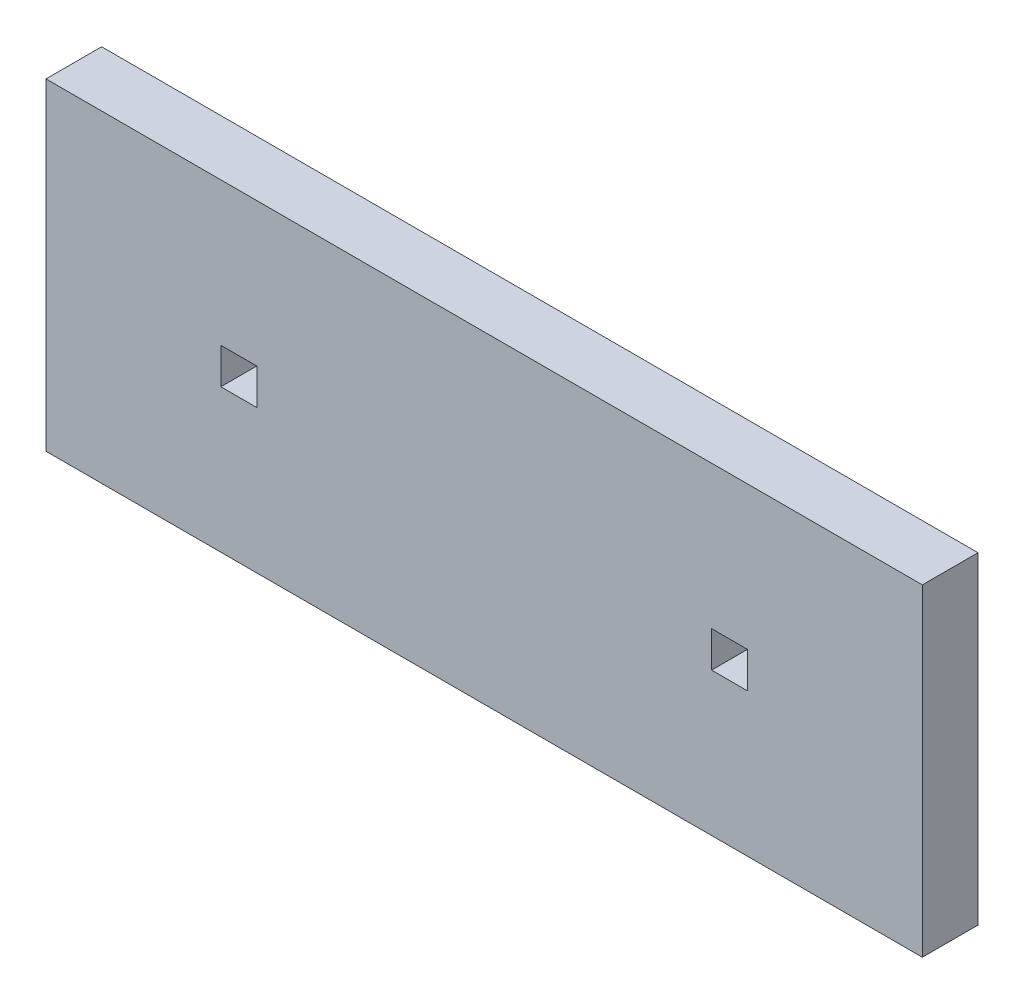
ISO-10303-21;
HEADER;
FILE_DESCRIPTION(('STEP AP214'),'2;1');
FILE_NAME('part.step','',(''),(''),'','','');
FILE_SCHEMA(('AUTOMOTIVE_DESIGN { 1 0 10303 214 1 1 1 1 }'));
ENDSEC;
DATA;
#1=APPLICATION_CONTEXT('core data for automotive mechanical design processes');
#2=APPLICATION_PROTOCOL_DEFINITION('international standard','automotive_design',2000,#1);
#3=PRODUCT_CONTEXT('',#1,'mechanical');
#4=PRODUCT('Part','Part','',(#3));
#5=PRODUCT_RELATED_PRODUCT_CATEGORY('part','',(#4));
#6=PRODUCT_DEFINITION_FORMATION('','',#4);
#7=PRODUCT_DEFINITION_CONTEXT('part definition',#1,'design');
#8=PRODUCT_DEFINITION('design','',#6,#7);
#9=PRODUCT_DEFINITION_SHAPE('','',#8);
#10=(LENGTH_UNIT() NAMED_UNIT(*) SI_UNIT(.MILLI.,.METRE.));
#11=(NAMED_UNIT(*) PLANE_ANGLE_UNIT() SI_UNIT($,.RADIAN.));
#12=(NAMED_UNIT(*) SI_UNIT($,.STERADIAN.) SOLID_ANGLE_UNIT());
#13=UNCERTAINTY_MEASURE_WITH_UNIT(LENGTH_MEASURE(1.E-05),#10,'distance_accuracy_value','');
#14=(GEOMETRIC_REPRESENTATION_CONTEXT(3) GLOBAL_UNCERTAINTY_ASSIGNED_CONTEXT((#13)) GLOBAL_UNIT_ASSIGNED_CONTEXT((#10,
#11,#12)) REPRESENTATION_CONTEXT('',''));
#15=CARTESIAN_POINT('',(0.,0.,0.));
#16=DIRECTION('',(0.,0.,1.));
#17=DIRECTION('',(1.,0.,0.));
#18=AXIS2_PLACEMENT_3D('',#15,#16,#17);
#19=CARTESIAN_POINT('',(0.,-2.61249429999999,3.175));
#20=DIRECTION('',(0.,-1.,0.));
#21=DIRECTION('',(0.,0.,-1.));
#22=AXIS2_PLACEMENT_3D('',#19,#20,#21);
#23=PLANE('',#22);
#24=DIRECTION('',(-1.,0.,0.));
#25=VECTOR('',#24,1.);
#26=CARTESIAN_POINT('',(0.,-2.61249429999999,0.));
#27=LINE('',#26,#25);
#28=CARTESIAN_POINT('',(15.025,-2.61249429999999,0.));
#29=VERTEX_POINT('',#28);
#30=CARTESIAN_POINT('',(12.975,-2.61249429999999,0.));
#31=VERTEX_POINT('',#30);
#32=EDGE_CURVE('E181',#29,#31,#27,.T.);
#33=ORIENTED_EDGE('',*,*,#32,.T.);
#34=DIRECTION('',(0.,0.,-1.));
#35=VECTOR('',#34,1.);
#36=CARTESIAN_POINT('',(12.975,-2.61249429999999,3.175));
#37=LINE('',#36,#35);
#38=CARTESIAN_POINT('',(12.975,-2.61249429999999,3.175));
#39=VERTEX_POINT('',#38);
#40=EDGE_CURVE('E11',#39,#31,#37,.T.);
#41=ORIENTED_EDGE('',*,*,#40,.F.);
#42=DIRECTION('',(-1.,0.,0.));
#43=VECTOR('',#42,1.);
#44=CARTESIAN_POINT('',(0.,-2.61249429999999,3.175));
#45=LINE('',#44,#43);
#46=CARTESIAN_POINT('',(15.025,-2.61249429999999,3.175));
#47=VERTEX_POINT('',#46);
#48=EDGE_CURVE('E140',#47,#39,#45,.T.);
#49=ORIENTED_EDGE('',*,*,#48,.F.);
#50=DIRECTION('',(0.,0.,-1.));
#51=VECTOR('',#50,1.);
#52=CARTESIAN_POINT('',(15.025,-2.61249429999999,3.175));
#53=LINE('',#52,#51);
#54=EDGE_CURVE('E56',#47,#29,#53,.T.);
#55=ORIENTED_EDGE('',*,*,#54,.T.);
#56=EDGE_LOOP('',(#33,#41,#49,#55));
#57=FACE_BOUND('',#56,.T.);
#58=ADVANCED_FACE('F37',(#57),#23,.F.);
#59=CARTESIAN_POINT('',(12.975,0.,3.175));
#60=DIRECTION('',(-1.,0.,0.));
#61=DIRECTION('',(0.,-1.,0.));
#62=AXIS2_PLACEMENT_3D('',#59,#60,#61);
#63=PLANE('',#62);
#64=DIRECTION('',(0.,1.,0.));
#65=VECTOR('',#64,1.);
#66=CARTESIAN_POINT('',(12.975,0.,0.));
#67=LINE('',#66,#65);
#68=CARTESIAN_POINT('',(12.975,-0.562494299999992,0.));
#69=VERTEX_POINT('',#68);
#70=EDGE_CURVE('E146',#31,#69,#67,.T.);
#71=ORIENTED_EDGE('',*,*,#70,.T.);
#72=DIRECTION('',(0.,0.,-1.));
#73=VECTOR('',#72,1.);
#74=CARTESIAN_POINT('',(12.975,-0.562494299999992,3.175));
#75=LINE('',#74,#73);
#76=CARTESIAN_POINT('',(12.975,-0.562494299999992,3.175));
#77=VERTEX_POINT('',#76);
#78=EDGE_CURVE('E47',#77,#69,#75,.T.);
#79=ORIENTED_EDGE('',*,*,#78,.F.);
#80=DIRECTION('',(0.,1.,0.));
#81=VECTOR('',#80,1.);
#82=CARTESIAN_POINT('',(12.975,0.,3.175));
#83=LINE('',#82,#81);
#84=EDGE_CURVE('E134',#39,#77,#83,.T.);
#85=ORIENTED_EDGE('',*,*,#84,.F.);
#86=ORIENTED_EDGE('',*,*,#40,.T.);
#87=EDGE_LOOP('',(#71,#79,#85,#86));
#88=FACE_BOUND('',#87,.T.);
#89=ADVANCED_FACE('F145',(#88),#63,.F.);
#90=CARTESIAN_POINT('',(0.,-0.562494299999991,3.175));
#91=DIRECTION('',(0.,-1.,0.));
#92=DIRECTION('',(1.,0.,0.));
#93=AXIS2_PLACEMENT_3D('',#90,#91,#92);
#94=PLANE('',#93);
#95=DIRECTION('',(-1.,0.,0.));
#96=VECTOR('',#95,1.);
#97=CARTESIAN_POINT('',(0.,-0.562494299999991,0.));
#98=LINE('',#97,#96);
#99=CARTESIAN_POINT('',(15.025,-0.562494299999992,0.));
#100=VERTEX_POINT('',#99);
#101=EDGE_CURVE('E184',#100,#69,#98,.T.);
#102=ORIENTED_EDGE('',*,*,#101,.F.);
#103=DIRECTION('',(0.,0.,-1.));
#104=VECTOR('',#103,1.);
#105=CARTESIAN_POINT('',(15.025,-0.562494299999992,3.175));
#106=LINE('',#105,#104);
#107=CARTESIAN_POINT('',(15.025,-0.562494299999992,3.175));
#108=VERTEX_POINT('',#107);
#109=EDGE_CURVE('E94',#108,#100,#106,.T.);
#110=ORIENTED_EDGE('',*,*,#109,.F.);
#111=DIRECTION('',(-1.,0.,0.));
#112=VECTOR('',#111,1.);
#113=CARTESIAN_POINT('',(0.,-0.562494299999991,3.175));
#114=LINE('',#113,#112);
#115=EDGE_CURVE('E139',#108,#77,#114,.T.);
#116=ORIENTED_EDGE('',*,*,#115,.T.);
#117=ORIENTED_EDGE('',*,*,#78,.T.);
#118=EDGE_LOOP('',(#102,#110,#116,#117));
#119=FACE_BOUND('',#118,.T.);
#120=ADVANCED_FACE('F150',(#119),#94,.T.);
#121=CARTESIAN_POINT('',(0.,-0.562494299999992,3.175));
#122=DIRECTION('',(0.,1.,0.));
#123=DIRECTION('',(0.,0.,1.));
#124=AXIS2_PLACEMENT_3D('',#121,#122,#123);
#125=PLANE('',#124);
#126=DIRECTION('',(1.,0.,0.));
#127=VECTOR('',#126,1.);
#128=CARTESIAN_POINT('',(0.,-0.562494299999992,0.));
#129=LINE('',#128,#127);
#130=CARTESIAN_POINT('',(-15.025,-0.562494299999992,0.));
#131=VERTEX_POINT('',#130);
#132=CARTESIAN_POINT('',(-12.975,-0.562494299999992,0.));
#133=VERTEX_POINT('',#132);
#134=EDGE_CURVE('E169',#131,#133,#129,.T.);
#135=ORIENTED_EDGE('',*,*,#134,.T.);
#136=DIRECTION('',(0.,0.,-1.));
#137=VECTOR('',#136,1.);
#138=CARTESIAN_POINT('',(-12.975,-0.562494299999992,3.175));
#139=LINE('',#138,#137);
#140=CARTESIAN_POINT('',(-12.975,-0.562494299999992,3.175));
#141=VERTEX_POINT('',#140);
#142=EDGE_CURVE('E191',#141,#133,#139,.T.);
#143=ORIENTED_EDGE('',*,*,#142,.F.);
#144=DIRECTION('',(1.,0.,0.));
#145=VECTOR('',#144,1.);
#146=CARTESIAN_POINT('',(0.,-0.562494299999992,3.175));
#147=LINE('',#146,#145);
#148=CARTESIAN_POINT('',(-15.025,-0.562494299999992,3.175));
#149=VERTEX_POINT('',#148);
#150=EDGE_CURVE('E226',#149,#141,#147,.T.);
#151=ORIENTED_EDGE('',*,*,#150,.F.);
#152=DIRECTION('',(0.,0.,-1.));
#153=VECTOR('',#152,1.);
#154=CARTESIAN_POINT('',(-15.025,-0.562494299999992,3.175));
#155=LINE('',#154,#153);
#156=EDGE_CURVE('E193',#149,#131,#155,.T.);
#157=ORIENTED_EDGE('',*,*,#156,.T.);
#158=EDGE_LOOP('',(#135,#143,#151,#157));
#159=FACE_BOUND('',#158,.T.);
#160=ADVANCED_FACE('F256',(#159),#125,.F.);
#161=CARTESIAN_POINT('',(-12.975,0.,3.175));
#162=DIRECTION('',(1.,0.,0.));
#163=DIRECTION('',(0.,1.,0.));
#164=AXIS2_PLACEMENT_3D('',#161,#162,#163);
#165=PLANE('',#164);
#166=DIRECTION('',(0.,-1.,0.));
#167=VECTOR('',#166,1.);
#168=CARTESIAN_POINT('',(-12.975,0.,0.));
#169=LINE('',#168,#167);
#170=CARTESIAN_POINT('',(-12.975,-2.61249429999999,0.));
#171=VERTEX_POINT('',#170);
#172=EDGE_CURVE('E172',#133,#171,#169,.T.);
#173=ORIENTED_EDGE('',*,*,#172,.T.);
#174=DIRECTION('',(0.,0.,-1.));
#175=VECTOR('',#174,1.);
#176=CARTESIAN_POINT('',(-12.975,-2.61249429999999,3.175));
#177=LINE('',#176,#175);
#178=CARTESIAN_POINT('',(-12.975,-2.61249429999999,3.175));
#179=VERTEX_POINT('',#178);
#180=EDGE_CURVE('E197',#179,#171,#177,.T.);
#181=ORIENTED_EDGE('',*,*,#180,.F.);
#182=DIRECTION('',(0.,-1.,0.));
#183=VECTOR('',#182,1.);
#184=CARTESIAN_POINT('',(-12.975,0.,3.175));
#185=LINE('',#184,#183);
#186=EDGE_CURVE('E235',#141,#179,#185,.T.);
#187=ORIENTED_EDGE('',*,*,#186,.F.);
#188=ORIENTED_EDGE('',*,*,#142,.T.);
#189=EDGE_LOOP('',(#173,#181,#187,#188));
#190=FACE_BOUND('',#189,.T.);
#191=ADVANCED_FACE('F258',(#190),#165,.F.);
#192=CARTESIAN_POINT('',(0.,-2.61249429999999,3.175));
#193=DIRECTION('',(0.,1.,0.));
#194=DIRECTION('',(0.,0.,1.));
#195=AXIS2_PLACEMENT_3D('',#192,#193,#194);
#196=PLANE('',#195);
#197=DIRECTION('',(1.,0.,0.));
#198=VECTOR('',#197,1.);
#199=CARTESIAN_POINT('',(0.,-2.61249429999999,0.));
#200=LINE('',#199,#198);
#201=CARTESIAN_POINT('',(-15.025,-2.61249429999999,0.));
#202=VERTEX_POINT('',#201);
#203=EDGE_CURVE('E175',#202,#171,#200,.T.);
#204=ORIENTED_EDGE('',*,*,#203,.F.);
#205=DIRECTION('',(0.,0.,-1.));
#206=VECTOR('',#205,1.);
#207=CARTESIAN_POINT('',(-15.025,-2.61249429999999,3.175));
#208=LINE('',#207,#206);
#209=CARTESIAN_POINT('',(-15.025,-2.61249429999999,3.175));
#210=VERTEX_POINT('',#209);
#211=EDGE_CURVE('E195',#210,#202,#208,.T.);
#212=ORIENTED_EDGE('',*,*,#211,.F.);
#213=DIRECTION('',(1.,0.,0.));
#214=VECTOR('',#213,1.);
#215=CARTESIAN_POINT('',(0.,-2.61249429999999,3.175));
#216=LINE('',#215,#214);
#217=EDGE_CURVE('E237',#210,#179,#216,.T.);
#218=ORIENTED_EDGE('',*,*,#217,.T.);
#219=ORIENTED_EDGE('',*,*,#180,.T.);
#220=EDGE_LOOP('',(#204,#212,#218,#219));
#221=FACE_BOUND('',#220,.T.);
#222=ADVANCED_FACE('F252',(#221),#196,.T.);
#223=CARTESIAN_POINT('',(0.,7.6124943,3.175));
#224=DIRECTION('',(0.,1.,0.));
#225=DIRECTION('',(0.,0.,1.));
#226=AXIS2_PLACEMENT_3D('',#223,#224,#225);
#227=PLANE('',#226);
#228=DIRECTION('',(1.,0.,0.));
#229=VECTOR('',#228,1.);
#230=CARTESIAN_POINT('',(0.,7.6124943,0.));
#231=LINE('',#230,#229);
#232=CARTESIAN_POINT('',(-25.,7.6124943,0.));
#233=VERTEX_POINT('',#232);
#234=CARTESIAN_POINT('',(25.,7.6124943,0.));
#235=VERTEX_POINT('',#234);
#236=EDGE_CURVE('E157',#233,#235,#231,.T.);
#237=ORIENTED_EDGE('',*,*,#236,.F.);
#238=DIRECTION('',(0.,0.,-1.));
#239=VECTOR('',#238,1.);
#240=CARTESIAN_POINT('',(-25.,7.6124943,3.175));
#241=LINE('',#240,#239);
#242=CARTESIAN_POINT('',(-25.,7.6124943,3.175));
#243=VERTEX_POINT('',#242);
#244=EDGE_CURVE('E41',#243,#233,#241,.T.);
#245=ORIENTED_EDGE('',*,*,#244,.F.);
#246=DIRECTION('',(1.,0.,0.));
#247=VECTOR('',#246,1.);
#248=CARTESIAN_POINT('',(0.,7.6124943,3.175));
#249=LINE('',#248,#247);
#250=CARTESIAN_POINT('',(25.,7.6124943,3.175));
#251=VERTEX_POINT('',#250);
#252=EDGE_CURVE('E189',#243,#251,#249,.T.);
#253=ORIENTED_EDGE('',*,*,#252,.T.);
#254=DIRECTION('',(0.,0.,-1.));
#255=VECTOR('',#254,1.);
#256=CARTESIAN_POINT('',(25.,7.6124943,3.175));
#257=LINE('',#256,#255);
#258=EDGE_CURVE('E153',#251,#235,#257,.T.);
#259=ORIENTED_EDGE('',*,*,#258,.T.);
#260=EDGE_LOOP('',(#237,#245,#253,#259));
#261=FACE_BOUND('',#260,.T.);
#262=ADVANCED_FACE('F39',(#261),#227,.T.);
#263=CARTESIAN_POINT('',(-25.,0.,3.175));
#264=DIRECTION('',(-1.,0.,0.));
#265=DIRECTION('',(0.,0.,1.));
#266=AXIS2_PLACEMENT_3D('',#263,#264,#265);
#267=PLANE('',#266);
#268=DIRECTION('',(0.,1.,0.));
#269=VECTOR('',#268,1.);
#270=CARTESIAN_POINT('',(-25.,0.,0.));
#271=LINE('',#270,#269);
#272=CARTESIAN_POINT('',(-25.,-10.7874943,0.));
#273=VERTEX_POINT('',#272);
#274=EDGE_CURVE('E160',#273,#233,#271,.T.);
#275=ORIENTED_EDGE('',*,*,#274,.F.);
#276=DIRECTION('',(0.,0.,-1.));
#277=VECTOR('',#276,1.);
#278=CARTESIAN_POINT('',(-25.,-10.7874943,3.175));
#279=LINE('',#278,#277);
#280=CARTESIAN_POINT('',(-25.,-10.7874943,3.175));
#281=VERTEX_POINT('',#280);
#282=EDGE_CURVE('E203',#281,#273,#279,.T.);
#283=ORIENTED_EDGE('',*,*,#282,.F.);
#284=DIRECTION('',(0.,1.,0.));
#285=VECTOR('',#284,1.);
#286=CARTESIAN_POINT('',(-25.,0.,3.175));
#287=LINE('',#286,#285);
#288=EDGE_CURVE('E212',#281,#243,#287,.T.);
#289=ORIENTED_EDGE('',*,*,#288,.T.);
#290=ORIENTED_EDGE('',*,*,#244,.T.);
#291=EDGE_LOOP('',(#275,#283,#289,#290));
#292=FACE_BOUND('',#291,.T.);
#293=ADVANCED_FACE('F210',(#292),#267,.T.);
#294=CARTESIAN_POINT('',(0.,-10.7874943,3.175));
#295=DIRECTION('',(0.,-1.,0.));
#296=DIRECTION('',(0.,0.,-1.));
#297=AXIS2_PLACEMENT_3D('',#294,#295,#296);
#298=PLANE('',#297);
#299=DIRECTION('',(-1.,0.,0.));
#300=VECTOR('',#299,1.);
#301=CARTESIAN_POINT('',(0.,-10.7874943,0.));
#302=LINE('',#301,#300);
#303=CARTESIAN_POINT('',(25.,-10.7874943,0.));
#304=VERTEX_POINT('',#303);
#305=EDGE_CURVE('E163',#304,#273,#302,.T.);
#306=ORIENTED_EDGE('',*,*,#305,.F.);
#307=DIRECTION('',(0.,0.,-1.));
#308=VECTOR('',#307,1.);
#309=CARTESIAN_POINT('',(25.,-10.7874943,3.175));
#310=LINE('',#309,#308);
#311=CARTESIAN_POINT('',(25.,-10.7874943,3.175));
#312=VERTEX_POINT('',#311);
#313=EDGE_CURVE('E202',#312,#304,#310,.T.);
#314=ORIENTED_EDGE('',*,*,#313,.F.);
#315=DIRECTION('',(-1.,0.,0.));
#316=VECTOR('',#315,1.);
#317=CARTESIAN_POINT('',(0.,-10.7874943,3.175));
#318=LINE('',#317,#316);
#319=EDGE_CURVE('E221',#312,#281,#318,.T.);
#320=ORIENTED_EDGE('',*,*,#319,.T.);
#321=ORIENTED_EDGE('',*,*,#282,.T.);
#322=EDGE_LOOP('',(#306,#314,#320,#321));
#323=FACE_BOUND('',#322,.T.);
#324=ADVANCED_FACE('F218',(#323),#298,.T.);
#325=CARTESIAN_POINT('',(-15.025,0.,3.175));
#326=DIRECTION('',(1.,0.,0.));
#327=DIRECTION('',(0.,0.,-1.));
#328=AXIS2_PLACEMENT_3D('',#325,#326,#327);
#329=PLANE('',#328);
#330=DIRECTION('',(0.,-1.,0.));
#331=VECTOR('',#330,1.);
#332=CARTESIAN_POINT('',(-15.025,0.,0.));
#333=LINE('',#332,#331);
#334=EDGE_CURVE('E178',#131,#202,#333,.T.);
#335=ORIENTED_EDGE('',*,*,#334,.F.);
#336=ORIENTED_EDGE('',*,*,#156,.F.);
#337=DIRECTION('',(0.,-1.,0.));
#338=VECTOR('',#337,1.);
#339=CARTESIAN_POINT('',(-15.025,0.,3.175));
#340=LINE('',#339,#338);
#341=EDGE_CURVE('E240',#149,#210,#340,.T.);
#342=ORIENTED_EDGE('',*,*,#341,.T.);
#343=ORIENTED_EDGE('',*,*,#211,.T.);
#344=EDGE_LOOP('',(#335,#336,#342,#343));
#345=FACE_BOUND('',#344,.T.);
#346=ADVANCED_FACE('F245',(#345),#329,.T.);
#347=CARTESIAN_POINT('',(25.,0.,3.175));
#348=DIRECTION('',(-1.,0.,0.));
#349=DIRECTION('',(0.,0.,1.));
#350=AXIS2_PLACEMENT_3D('',#347,#348,#349);
#351=PLANE('',#350);
#352=DIRECTION('',(0.,1.,0.));
#353=VECTOR('',#352,1.);
#354=CARTESIAN_POINT('',(25.,0.,0.));
#355=LINE('',#354,#353);
#356=EDGE_CURVE('E166',#304,#235,#355,.T.);
#357=ORIENTED_EDGE('',*,*,#356,.T.);
#358=ORIENTED_EDGE('',*,*,#258,.F.);
#359=DIRECTION('',(0.,1.,0.));
#360=VECTOR('',#359,1.);
#361=CARTESIAN_POINT('',(25.,0.,3.175));
#362=LINE('',#361,#360);
#363=EDGE_CURVE('E223',#312,#251,#362,.T.);
#364=ORIENTED_EDGE('',*,*,#363,.F.);
#365=ORIENTED_EDGE('',*,*,#313,.T.);
#366=EDGE_LOOP('',(#357,#358,#364,#365));
#367=FACE_BOUND('',#366,.T.);
#368=ADVANCED_FACE('F224',(#367),#351,.F.);
#369=CARTESIAN_POINT('',(15.025,0.,3.175));
#370=DIRECTION('',(-1.,0.,0.));
#371=DIRECTION('',(0.,0.,1.));
#372=AXIS2_PLACEMENT_3D('',#369,#370,#371);
#373=PLANE('',#372);
#374=DIRECTION('',(0.,1.,0.));
#375=VECTOR('',#374,1.);
#376=CARTESIAN_POINT('',(15.025,0.,0.));
#377=LINE('',#376,#375);
#378=EDGE_CURVE('E186',#29,#100,#377,.T.);
#379=ORIENTED_EDGE('',*,*,#378,.F.);
#380=ORIENTED_EDGE('',*,*,#54,.F.);
#381=DIRECTION('',(0.,1.,0.));
#382=VECTOR('',#381,1.);
#383=CARTESIAN_POINT('',(15.025,0.,3.175));
#384=LINE('',#383,#382);
#385=EDGE_CURVE('E151',#47,#108,#384,.T.);
#386=ORIENTED_EDGE('',*,*,#385,.T.);
#387=ORIENTED_EDGE('',*,*,#109,.T.);
#388=EDGE_LOOP('',(#379,#380,#386,#387));
#389=FACE_BOUND('',#388,.T.);
#390=ADVANCED_FACE('F280',(#389),#373,.T.);
#391=CARTESIAN_POINT('',(0.,0.,3.175));
#392=DIRECTION('',(0.,0.,1.));
#393=DIRECTION('',(1.,0.,0.));
#394=AXIS2_PLACEMENT_3D('',#391,#392,#393);
#395=PLANE('',#394);
#396=ORIENTED_EDGE('',*,*,#252,.F.);
#397=ORIENTED_EDGE('',*,*,#288,.F.);
#398=ORIENTED_EDGE('',*,*,#319,.F.);
#399=ORIENTED_EDGE('',*,*,#363,.T.);
#400=EDGE_LOOP('',(#396,#397,#398,#399));
#401=FACE_BOUND('',#400,.T.);
#402=ORIENTED_EDGE('',*,*,#150,.T.);
#403=ORIENTED_EDGE('',*,*,#186,.T.);
#404=ORIENTED_EDGE('',*,*,#217,.F.);
#405=ORIENTED_EDGE('',*,*,#341,.F.);
#406=EDGE_LOOP('',(#402,#403,#404,#405));
#407=FACE_BOUND('',#406,.T.);
#408=ORIENTED_EDGE('',*,*,#48,.T.);
#409=ORIENTED_EDGE('',*,*,#84,.T.);
#410=ORIENTED_EDGE('',*,*,#115,.F.);
#411=ORIENTED_EDGE('',*,*,#385,.F.);
#412=EDGE_LOOP('',(#408,#409,#410,#411));
#413=FACE_BOUND('',#412,.T.);
#414=ADVANCED_FACE('F136',(#401,#407,#413),#395,.T.);
#415=CARTESIAN_POINT('',(0.,0.,0.));
#416=DIRECTION('',(0.,0.,1.));
#417=DIRECTION('',(1.,0.,0.));
#418=AXIS2_PLACEMENT_3D('',#415,#416,#417);
#419=PLANE('',#418);
#420=ORIENTED_EDGE('',*,*,#236,.T.);
#421=ORIENTED_EDGE('',*,*,#356,.F.);
#422=ORIENTED_EDGE('',*,*,#305,.T.);
#423=ORIENTED_EDGE('',*,*,#274,.T.);
#424=EDGE_LOOP('',(#420,#421,#422,#423));
#425=FACE_BOUND('',#424,.T.);
#426=ORIENTED_EDGE('',*,*,#134,.F.);
#427=ORIENTED_EDGE('',*,*,#334,.T.);
#428=ORIENTED_EDGE('',*,*,#203,.T.);
#429=ORIENTED_EDGE('',*,*,#172,.F.);
#430=EDGE_LOOP('',(#426,#427,#428,#429));
#431=FACE_BOUND('',#430,.T.);
#432=ORIENTED_EDGE('',*,*,#32,.F.);
#433=ORIENTED_EDGE('',*,*,#378,.T.);
#434=ORIENTED_EDGE('',*,*,#101,.T.);
#435=ORIENTED_EDGE('',*,*,#70,.F.);
#436=EDGE_LOOP('',(#432,#433,#434,#435));
#437=FACE_BOUND('',#436,.T.);
#438=ADVANCED_FACE('F216',(#425,#431,#437),#419,.F.);
#439=CLOSED_SHELL('',(#58,#89,#120,#160,#191,#222,#262,#293,#324,#346,#368,#390,#414,#438));
#440=MANIFOLD_SOLID_BREP('B2',#439);
#441=ADVANCED_BREP_SHAPE_REPRESENTATION('',(#18,#440),#14);
#442=SHAPE_DEFINITION_REPRESENTATION(#9,#441);
ENDSEC;
END-ISO-10303-21;
